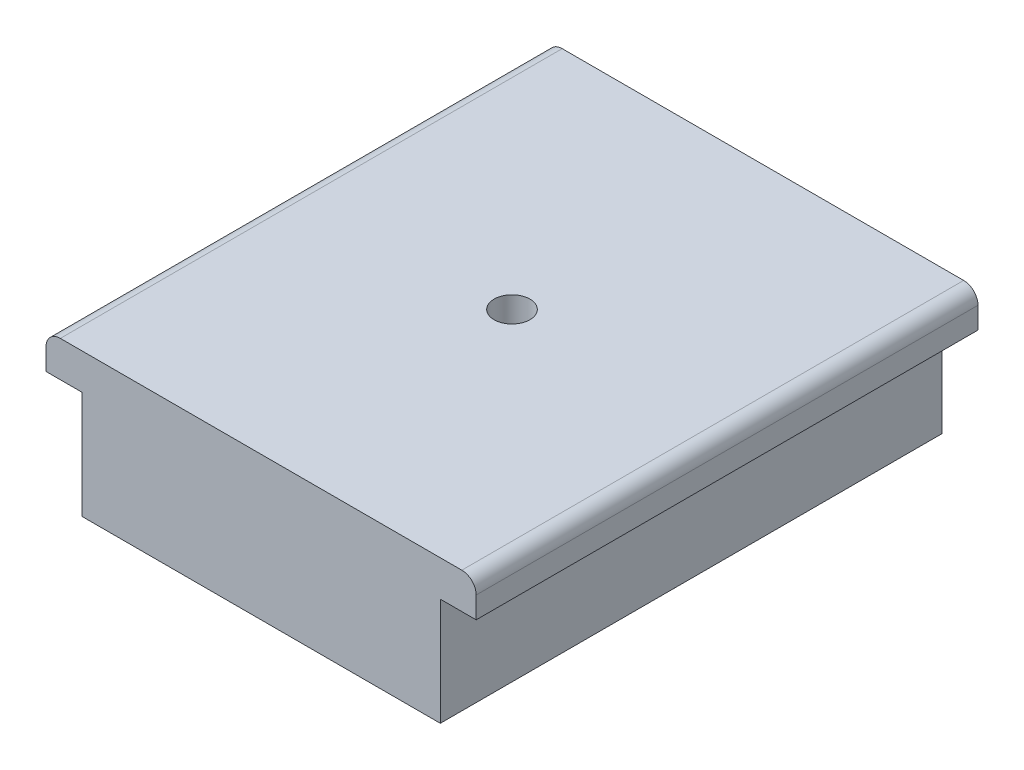
ISO-10303-21;
HEADER;
FILE_DESCRIPTION(('STEP AP214'),'2;1');
FILE_NAME('part.step','',(''),(''),'','','');
FILE_SCHEMA(('AUTOMOTIVE_DESIGN { 1 0 10303 214 1 1 1 1 }'));
ENDSEC;
DATA;
#1=APPLICATION_CONTEXT('core data for automotive mechanical design processes');
#2=APPLICATION_PROTOCOL_DEFINITION('international standard','automotive_design',2000,#1);
#3=PRODUCT_CONTEXT('',#1,'mechanical');
#4=PRODUCT('Part','Part','',(#3));
#5=PRODUCT_RELATED_PRODUCT_CATEGORY('part','',(#4));
#6=PRODUCT_DEFINITION_FORMATION('','',#4);
#7=PRODUCT_DEFINITION_CONTEXT('part definition',#1,'design');
#8=PRODUCT_DEFINITION('design','',#6,#7);
#9=PRODUCT_DEFINITION_SHAPE('','',#8);
#10=(LENGTH_UNIT() NAMED_UNIT(*) SI_UNIT(.MILLI.,.METRE.));
#11=(NAMED_UNIT(*) PLANE_ANGLE_UNIT() SI_UNIT($,.RADIAN.));
#12=(NAMED_UNIT(*) SI_UNIT($,.STERADIAN.) SOLID_ANGLE_UNIT());
#13=UNCERTAINTY_MEASURE_WITH_UNIT(LENGTH_MEASURE(1.E-05),#10,'distance_accuracy_value','');
#14=(GEOMETRIC_REPRESENTATION_CONTEXT(3) GLOBAL_UNCERTAINTY_ASSIGNED_CONTEXT((#13)) GLOBAL_UNIT_ASSIGNED_CONTEXT((#10,
#11,#12)) REPRESENTATION_CONTEXT('',''));
#15=CARTESIAN_POINT('',(0.,0.,0.));
#16=DIRECTION('',(0.,0.,1.));
#17=DIRECTION('',(1.,0.,0.));
#18=AXIS2_PLACEMENT_3D('',#15,#16,#17);
#19=CARTESIAN_POINT('',(-25.,-7.5,35.));
#20=DIRECTION('',(1.,0.,0.));
#21=DIRECTION('',(0.,0.,-1.));
#22=AXIS2_PLACEMENT_3D('',#19,#20,#21);
#23=PLANE('',#22);
#24=DIRECTION('',(0.,-1.,0.));
#25=VECTOR('',#24,1.);
#26=CARTESIAN_POINT('',(-25.,-7.5,-35.));
#27=LINE('',#26,#25);
#28=CARTESIAN_POINT('',(-25.,7.5,-35.));
#29=VERTEX_POINT('',#28);
#30=CARTESIAN_POINT('',(-25.,-7.5,-35.));
#31=VERTEX_POINT('',#30);
#32=EDGE_CURVE('E119',#29,#31,#27,.T.);
#33=ORIENTED_EDGE('',*,*,#32,.T.);
#34=DIRECTION('',(0.,0.,-1.));
#35=VECTOR('',#34,1.);
#36=CARTESIAN_POINT('',(-25.,-7.5,35.));
#37=LINE('',#36,#35);
#38=CARTESIAN_POINT('',(-25.,-7.5,35.));
#39=VERTEX_POINT('',#38);
#40=EDGE_CURVE('E175',#39,#31,#37,.T.);
#41=ORIENTED_EDGE('',*,*,#40,.F.);
#42=DIRECTION('',(0.,-1.,0.));
#43=VECTOR('',#42,1.);
#44=CARTESIAN_POINT('',(-25.,-7.5,35.));
#45=LINE('',#44,#43);
#46=CARTESIAN_POINT('',(-25.,7.5,35.));
#47=VERTEX_POINT('',#46);
#48=EDGE_CURVE('E156',#47,#39,#45,.T.);
#49=ORIENTED_EDGE('',*,*,#48,.F.);
#50=DIRECTION('',(0.,0.,-1.));
#51=VECTOR('',#50,1.);
#52=CARTESIAN_POINT('',(-25.,7.5,35.));
#53=LINE('',#52,#51);
#54=EDGE_CURVE('E128',#47,#29,#53,.T.);
#55=ORIENTED_EDGE('',*,*,#54,.T.);
#56=EDGE_LOOP('',(#33,#41,#49,#55));
#57=FACE_BOUND('',#56,.T.);
#58=ADVANCED_FACE('F35',(#57),#23,.F.);
#59=CARTESIAN_POINT('',(25.,-7.5,35.));
#60=DIRECTION('',(0.,1.,0.));
#61=DIRECTION('',(0.,0.,1.));
#62=AXIS2_PLACEMENT_3D('',#59,#60,#61);
#63=PLANE('',#62);
#64=DIRECTION('',(1.,0.,0.));
#65=VECTOR('',#64,1.);
#66=CARTESIAN_POINT('',(25.,-7.5,-35.));
#67=LINE('',#66,#65);
#68=CARTESIAN_POINT('',(25.,-7.5,-35.));
#69=VERTEX_POINT('',#68);
#70=EDGE_CURVE('E165',#31,#69,#67,.T.);
#71=ORIENTED_EDGE('',*,*,#70,.T.);
#72=DIRECTION('',(0.,0.,-1.));
#73=VECTOR('',#72,1.);
#74=CARTESIAN_POINT('',(25.,-7.5,35.));
#75=LINE('',#74,#73);
#76=CARTESIAN_POINT('',(25.,-7.5,35.));
#77=VERTEX_POINT('',#76);
#78=EDGE_CURVE('E172',#77,#69,#75,.T.);
#79=ORIENTED_EDGE('',*,*,#78,.F.);
#80=DIRECTION('',(1.,0.,0.));
#81=VECTOR('',#80,1.);
#82=CARTESIAN_POINT('',(25.,-7.5,35.));
#83=LINE('',#82,#81);
#84=EDGE_CURVE('E158',#39,#77,#83,.T.);
#85=ORIENTED_EDGE('',*,*,#84,.F.);
#86=ORIENTED_EDGE('',*,*,#40,.T.);
#87=EDGE_LOOP('',(#71,#79,#85,#86));
#88=FACE_BOUND('',#87,.T.);
#89=ADVANCED_FACE('F210',(#88),#63,.F.);
#90=CARTESIAN_POINT('',(25.,-7.5,35.));
#91=DIRECTION('',(-1.,0.,0.));
#92=DIRECTION('',(0.,0.,1.));
#93=AXIS2_PLACEMENT_3D('',#90,#91,#92);
#94=PLANE('',#93);
#95=DIRECTION('',(0.,1.,0.));
#96=VECTOR('',#95,1.);
#97=CARTESIAN_POINT('',(25.,-7.5,-35.));
#98=LINE('',#97,#96);
#99=CARTESIAN_POINT('',(25.,7.5,-35.));
#100=VERTEX_POINT('',#99);
#101=EDGE_CURVE('E159',#69,#100,#98,.T.);
#102=ORIENTED_EDGE('',*,*,#101,.T.);
#103=DIRECTION('',(0.,0.,-1.));
#104=VECTOR('',#103,1.);
#105=CARTESIAN_POINT('',(25.,7.5,35.));
#106=LINE('',#105,#104);
#107=CARTESIAN_POINT('',(25.,7.5,35.));
#108=VERTEX_POINT('',#107);
#109=EDGE_CURVE('E169',#108,#100,#106,.T.);
#110=ORIENTED_EDGE('',*,*,#109,.F.);
#111=DIRECTION('',(0.,1.,0.));
#112=VECTOR('',#111,1.);
#113=CARTESIAN_POINT('',(25.,-7.5,35.));
#114=LINE('',#113,#112);
#115=EDGE_CURVE('E161',#77,#108,#114,.T.);
#116=ORIENTED_EDGE('',*,*,#115,.F.);
#117=ORIENTED_EDGE('',*,*,#78,.T.);
#118=EDGE_LOOP('',(#102,#110,#116,#117));
#119=FACE_BOUND('',#118,.T.);
#120=ADVANCED_FACE('F215',(#119),#94,.F.);
#121=CARTESIAN_POINT('',(0.,0.,35.));
#122=DIRECTION('',(0.,0.,1.));
#123=DIRECTION('',(1.,0.,0.));
#124=AXIS2_PLACEMENT_3D('',#121,#122,#123);
#125=PLANE('',#124);
#126=DIRECTION('',(1.,0.,0.));
#127=VECTOR('',#126,1.);
#128=CARTESIAN_POINT('',(30.,12.5,35.));
#129=LINE('',#128,#127);
#130=CARTESIAN_POINT('',(-28.,12.5,35.));
#131=VERTEX_POINT('',#130);
#132=CARTESIAN_POINT('',(28.,12.5,35.));
#133=VERTEX_POINT('',#132);
#134=EDGE_CURVE('E151',#131,#133,#129,.T.);
#135=ORIENTED_EDGE('',*,*,#134,.F.);
#136=CARTESIAN_POINT('',(-28.,10.5,35.));
#137=DIRECTION('',(0.,0.,1.));
#138=DIRECTION('',(1.,0.,0.));
#139=AXIS2_PLACEMENT_3D('',#136,#137,#138);
#140=CIRCLE('',#139,2.);
#141=CARTESIAN_POINT('',(-30.,10.5,35.));
#142=VERTEX_POINT('',#141);
#143=EDGE_CURVE('E117',#131,#142,#140,.T.);
#144=ORIENTED_EDGE('',*,*,#143,.T.);
#145=DIRECTION('',(0.,-1.,0.));
#146=VECTOR('',#145,1.);
#147=CARTESIAN_POINT('',(-30.,12.5,35.));
#148=LINE('',#147,#146);
#149=CARTESIAN_POINT('',(-30.,7.5,35.));
#150=VERTEX_POINT('',#149);
#151=EDGE_CURVE('E111',#142,#150,#148,.T.);
#152=ORIENTED_EDGE('',*,*,#151,.T.);
#153=DIRECTION('',(1.,0.,0.));
#154=VECTOR('',#153,1.);
#155=CARTESIAN_POINT('',(30.,7.5,35.));
#156=LINE('',#155,#154);
#157=EDGE_CURVE('E116',#150,#47,#156,.T.);
#158=ORIENTED_EDGE('',*,*,#157,.T.);
#159=ORIENTED_EDGE('',*,*,#48,.T.);
#160=ORIENTED_EDGE('',*,*,#84,.T.);
#161=ORIENTED_EDGE('',*,*,#115,.T.);
#162=CARTESIAN_POINT('',(30.,7.5,35.));
#163=VERTEX_POINT('',#162);
#164=EDGE_CURVE('E130',#108,#163,#156,.T.);
#165=ORIENTED_EDGE('',*,*,#164,.T.);
#166=DIRECTION('',(0.,-1.,0.));
#167=VECTOR('',#166,1.);
#168=CARTESIAN_POINT('',(30.,12.5,35.));
#169=LINE('',#168,#167);
#170=CARTESIAN_POINT('',(30.,10.5,35.));
#171=VERTEX_POINT('',#170);
#172=EDGE_CURVE('E120',#171,#163,#169,.T.);
#173=ORIENTED_EDGE('',*,*,#172,.F.);
#174=CARTESIAN_POINT('',(28.,10.5,35.));
#175=DIRECTION('',(0.,0.,1.));
#176=DIRECTION('',(1.,0.,0.));
#177=AXIS2_PLACEMENT_3D('',#174,#175,#176);
#178=CIRCLE('',#177,2.);
#179=EDGE_CURVE('E184',#171,#133,#178,.T.);
#180=ORIENTED_EDGE('',*,*,#179,.T.);
#181=EDGE_LOOP('',(#135,#144,#152,#158,#159,#160,#161,#165,#173,#180));
#182=FACE_BOUND('',#181,.T.);
#183=ADVANCED_FACE('F114',(#182),#125,.T.);
#184=CARTESIAN_POINT('',(0.,0.,-35.));
#185=DIRECTION('',(0.,0.,1.));
#186=DIRECTION('',(1.,0.,0.));
#187=AXIS2_PLACEMENT_3D('',#184,#185,#186);
#188=PLANE('',#187);
#189=DIRECTION('',(0.,-1.,0.));
#190=VECTOR('',#189,1.);
#191=CARTESIAN_POINT('',(-30.,12.5,-35.));
#192=LINE('',#191,#190);
#193=CARTESIAN_POINT('',(-30.,10.5,-35.));
#194=VERTEX_POINT('',#193);
#195=CARTESIAN_POINT('',(-30.,7.5,-35.));
#196=VERTEX_POINT('',#195);
#197=EDGE_CURVE('E133',#194,#196,#192,.T.);
#198=ORIENTED_EDGE('',*,*,#197,.F.);
#199=CARTESIAN_POINT('',(-28.,10.5,-35.));
#200=DIRECTION('',(0.,0.,1.));
#201=DIRECTION('',(1.,0.,0.));
#202=AXIS2_PLACEMENT_3D('',#199,#200,#201);
#203=CIRCLE('',#202,2.);
#204=CARTESIAN_POINT('',(-28.,12.5,-35.));
#205=VERTEX_POINT('',#204);
#206=EDGE_CURVE('E43',#194,#205,#203,.F.);
#207=ORIENTED_EDGE('',*,*,#206,.T.);
#208=DIRECTION('',(-1.,0.,0.));
#209=VECTOR('',#208,1.);
#210=CARTESIAN_POINT('',(30.,12.5,-35.));
#211=LINE('',#210,#209);
#212=CARTESIAN_POINT('',(28.,12.5,-35.));
#213=VERTEX_POINT('',#212);
#214=EDGE_CURVE('E142',#213,#205,#211,.T.);
#215=ORIENTED_EDGE('',*,*,#214,.F.);
#216=CARTESIAN_POINT('',(28.,10.5,-35.));
#217=DIRECTION('',(0.,0.,1.));
#218=DIRECTION('',(1.,0.,0.));
#219=AXIS2_PLACEMENT_3D('',#216,#217,#218);
#220=CIRCLE('',#219,2.);
#221=CARTESIAN_POINT('',(30.,10.5,-35.));
#222=VERTEX_POINT('',#221);
#223=EDGE_CURVE('E50',#213,#222,#220,.F.);
#224=ORIENTED_EDGE('',*,*,#223,.T.);
#225=DIRECTION('',(0.,-1.,0.));
#226=VECTOR('',#225,1.);
#227=CARTESIAN_POINT('',(30.,12.5,-35.));
#228=LINE('',#227,#226);
#229=CARTESIAN_POINT('',(30.,7.5,-35.));
#230=VERTEX_POINT('',#229);
#231=EDGE_CURVE('E153',#222,#230,#228,.T.);
#232=ORIENTED_EDGE('',*,*,#231,.T.);
#233=DIRECTION('',(-1.,0.,0.));
#234=VECTOR('',#233,1.);
#235=CARTESIAN_POINT('',(30.,7.5,-35.));
#236=LINE('',#235,#234);
#237=EDGE_CURVE('E148',#230,#100,#236,.T.);
#238=ORIENTED_EDGE('',*,*,#237,.T.);
#239=ORIENTED_EDGE('',*,*,#101,.F.);
#240=ORIENTED_EDGE('',*,*,#70,.F.);
#241=ORIENTED_EDGE('',*,*,#32,.F.);
#242=EDGE_CURVE('E147',#29,#196,#236,.T.);
#243=ORIENTED_EDGE('',*,*,#242,.T.);
#244=EDGE_LOOP('',(#198,#207,#215,#224,#232,#238,#239,#240,#241,#243));
#245=FACE_BOUND('',#244,.T.);
#246=ADVANCED_FACE('F190',(#245),#188,.F.);
#247=CARTESIAN_POINT('',(0.,7.5,0.));
#248=DIRECTION('',(0.,-1.,0.));
#249=DIRECTION('',(0.,0.,-1.));
#250=AXIS2_PLACEMENT_3D('',#247,#248,#249);
#251=PLANE('',#250);
#252=ORIENTED_EDGE('',*,*,#54,.F.);
#253=ORIENTED_EDGE('',*,*,#157,.F.);
#254=DIRECTION('',(0.,0.,1.));
#255=VECTOR('',#254,1.);
#256=CARTESIAN_POINT('',(-30.,7.5,-35.));
#257=LINE('',#256,#255);
#258=EDGE_CURVE('E127',#196,#150,#257,.T.);
#259=ORIENTED_EDGE('',*,*,#258,.F.);
#260=ORIENTED_EDGE('',*,*,#242,.F.);
#261=EDGE_LOOP('',(#252,#253,#259,#260));
#262=FACE_BOUND('',#261,.T.);
#263=ADVANCED_FACE('F125',(#262),#251,.T.);
#264=CARTESIAN_POINT('',(-30.,12.5,-35.));
#265=DIRECTION('',(1.,0.,0.));
#266=DIRECTION('',(0.,0.,-1.));
#267=AXIS2_PLACEMENT_3D('',#264,#265,#266);
#268=PLANE('',#267);
#269=ORIENTED_EDGE('',*,*,#151,.F.);
#270=DIRECTION('',(0.,0.,1.));
#271=VECTOR('',#270,1.);
#272=CARTESIAN_POINT('',(-30.,10.5,-35.));
#273=LINE('',#272,#271);
#274=EDGE_CURVE('E58',#142,#194,#273,.F.);
#275=ORIENTED_EDGE('',*,*,#274,.T.);
#276=ORIENTED_EDGE('',*,*,#197,.T.);
#277=ORIENTED_EDGE('',*,*,#258,.T.);
#278=EDGE_LOOP('',(#269,#275,#276,#277));
#279=FACE_BOUND('',#278,.T.);
#280=ADVANCED_FACE('F132',(#279),#268,.F.);
#281=CARTESIAN_POINT('',(30.,12.5,-35.));
#282=DIRECTION('',(-1.,0.,0.));
#283=DIRECTION('',(0.,0.,1.));
#284=AXIS2_PLACEMENT_3D('',#281,#282,#283);
#285=PLANE('',#284);
#286=ORIENTED_EDGE('',*,*,#231,.F.);
#287=DIRECTION('',(0.,0.,-1.));
#288=VECTOR('',#287,1.);
#289=CARTESIAN_POINT('',(30.,10.5,-35.));
#290=LINE('',#289,#288);
#291=EDGE_CURVE('E11',#222,#171,#290,.F.);
#292=ORIENTED_EDGE('',*,*,#291,.T.);
#293=ORIENTED_EDGE('',*,*,#172,.T.);
#294=DIRECTION('',(0.,0.,-1.));
#295=VECTOR('',#294,1.);
#296=CARTESIAN_POINT('',(30.,7.5,-35.));
#297=LINE('',#296,#295);
#298=EDGE_CURVE('E129',#163,#230,#297,.T.);
#299=ORIENTED_EDGE('',*,*,#298,.T.);
#300=EDGE_LOOP('',(#286,#292,#293,#299));
#301=FACE_BOUND('',#300,.T.);
#302=ADVANCED_FACE('F228',(#301),#285,.F.);
#303=CARTESIAN_POINT('',(0.,12.5,0.));
#304=DIRECTION('',(0.,-1.,0.));
#305=DIRECTION('',(0.,0.,-1.));
#306=AXIS2_PLACEMENT_3D('',#303,#304,#305);
#307=PLANE('',#306);
#308=CARTESIAN_POINT('',(0.,12.5,0.));
#309=DIRECTION('',(0.,-1.,0.));
#310=DIRECTION('',(0.,0.,-1.));
#311=AXIS2_PLACEMENT_3D('',#308,#309,#310);
#312=CIRCLE('',#311,2.5);
#313=CARTESIAN_POINT('',(0.,12.5,-2.5));
#314=VERTEX_POINT('',#313);
#315=EDGE_CURVE('E135',#314,#314,#312,.F.);
#316=ORIENTED_EDGE('',*,*,#315,.F.);
#317=EDGE_LOOP('',(#316));
#318=FACE_BOUND('',#317,.T.);
#319=ORIENTED_EDGE('',*,*,#214,.T.);
#320=DIRECTION('',(0.,0.,1.));
#321=VECTOR('',#320,1.);
#322=CARTESIAN_POINT('',(-28.,12.5,0.));
#323=LINE('',#322,#321);
#324=EDGE_CURVE('E181',#205,#131,#323,.T.);
#325=ORIENTED_EDGE('',*,*,#324,.T.);
#326=ORIENTED_EDGE('',*,*,#134,.T.);
#327=DIRECTION('',(0.,0.,-1.));
#328=VECTOR('',#327,1.);
#329=CARTESIAN_POINT('',(28.,12.5,0.));
#330=LINE('',#329,#328);
#331=EDGE_CURVE('E177',#133,#213,#330,.T.);
#332=ORIENTED_EDGE('',*,*,#331,.T.);
#333=EDGE_LOOP('',(#319,#325,#326,#332));
#334=FACE_BOUND('',#333,.T.);
#335=ADVANCED_FACE('F194',(#318,#334),#307,.F.);
#336=ORIENTED_EDGE('',*,*,#164,.F.);
#337=ORIENTED_EDGE('',*,*,#109,.T.);
#338=ORIENTED_EDGE('',*,*,#237,.F.);
#339=ORIENTED_EDGE('',*,*,#298,.F.);
#340=EDGE_LOOP('',(#336,#337,#338,#339));
#341=FACE_BOUND('',#340,.T.);
#342=ADVANCED_FACE('F232',(#341),#251,.T.);
#343=CARTESIAN_POINT('',(0.,12.500012,0.));
#344=DIRECTION('',(0.,-1.,0.));
#345=DIRECTION('',(0.,0.,-1.));
#346=AXIS2_PLACEMENT_3D('',#343,#344,#345);
#347=CYLINDRICAL_SURFACE('',#346,2.5);
#348=CARTESIAN_POINT('',(0.,2.5,0.));
#349=DIRECTION('',(0.,1.,0.));
#350=DIRECTION('',(0.,0.,1.));
#351=AXIS2_PLACEMENT_3D('',#348,#349,#350);
#352=CIRCLE('',#351,2.5);
#353=CARTESIAN_POINT('',(0.,2.5,2.5));
#354=VERTEX_POINT('',#353);
#355=EDGE_CURVE('E139',#354,#354,#352,.T.);
#356=ORIENTED_EDGE('',*,*,#355,.F.);
#357=EDGE_LOOP('',(#356));
#358=FACE_BOUND('',#357,.T.);
#359=ORIENTED_EDGE('',*,*,#315,.T.);
#360=EDGE_LOOP('',(#359));
#361=FACE_BOUND('',#360,.T.);
#362=ADVANCED_FACE('F205',(#358,#361),#347,.F.);
#363=CARTESIAN_POINT('',(0.,2.5,0.));
#364=DIRECTION('',(0.,1.,0.));
#365=DIRECTION('',(0.,0.,1.));
#366=AXIS2_PLACEMENT_3D('',#363,#364,#365);
#367=PLANE('',#366);
#368=ORIENTED_EDGE('',*,*,#355,.T.);
#369=EDGE_LOOP('',(#368));
#370=FACE_BOUND('',#369,.T.);
#371=ADVANCED_FACE('F199',(#370),#367,.T.);
#372=CARTESIAN_POINT('',(-28.,10.5,0.));
#373=DIRECTION('',(0.,0.,1.));
#374=DIRECTION('',(1.,0.,0.));
#375=AXIS2_PLACEMENT_3D('',#372,#373,#374);
#376=CYLINDRICAL_SURFACE('',#375,2.);
#377=ORIENTED_EDGE('',*,*,#206,.F.);
#378=ORIENTED_EDGE('',*,*,#274,.F.);
#379=ORIENTED_EDGE('',*,*,#143,.F.);
#380=ORIENTED_EDGE('',*,*,#324,.F.);
#381=EDGE_LOOP('',(#377,#378,#379,#380));
#382=FACE_BOUND('',#381,.T.);
#383=ADVANCED_FACE('F197',(#382),#376,.T.);
#384=CARTESIAN_POINT('',(28.,10.5,0.));
#385=DIRECTION('',(0.,0.,-1.));
#386=DIRECTION('',(-1.,0.,0.));
#387=AXIS2_PLACEMENT_3D('',#384,#385,#386);
#388=CYLINDRICAL_SURFACE('',#387,2.);
#389=ORIENTED_EDGE('',*,*,#179,.F.);
#390=ORIENTED_EDGE('',*,*,#291,.F.);
#391=ORIENTED_EDGE('',*,*,#223,.F.);
#392=ORIENTED_EDGE('',*,*,#331,.F.);
#393=EDGE_LOOP('',(#389,#390,#391,#392));
#394=FACE_BOUND('',#393,.T.);
#395=ADVANCED_FACE('F37',(#394),#388,.T.);
#396=CLOSED_SHELL('',(#58,#89,#120,#183,#246,#263,#280,#302,#335,#342,#362,#371,#383,#395));
#397=MANIFOLD_SOLID_BREP('B2',#396);
#398=ADVANCED_BREP_SHAPE_REPRESENTATION('',(#18,#397),#14);
#399=SHAPE_DEFINITION_REPRESENTATION(#9,#398);
ENDSEC;
END-ISO-10303-21;
